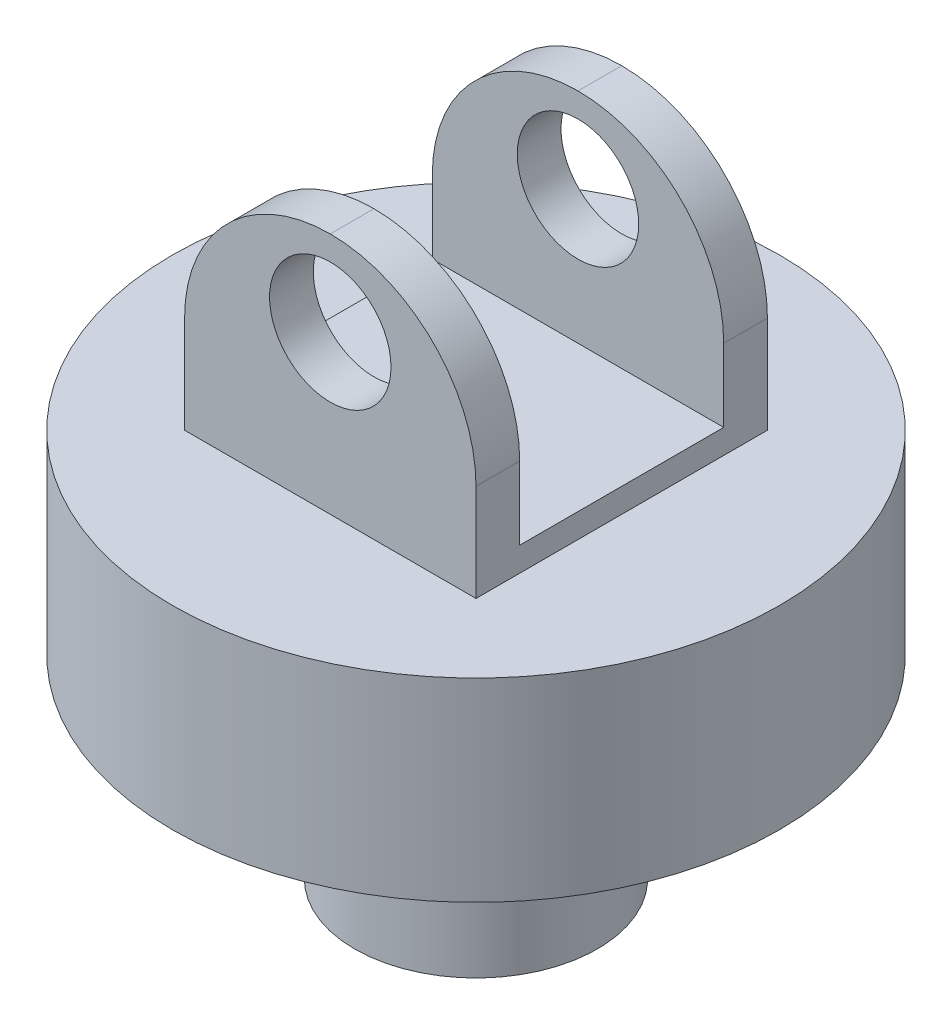
ISO-10303-21;
HEADER;
FILE_DESCRIPTION(('STEP AP214'),'2;1');
FILE_NAME('part.step','',(''),(''),'','','');
FILE_SCHEMA(('AUTOMOTIVE_DESIGN { 1 0 10303 214 1 1 1 1 }'));
ENDSEC;
DATA;
#1=APPLICATION_CONTEXT('core data for automotive mechanical design processes');
#2=APPLICATION_PROTOCOL_DEFINITION('international standard','automotive_design',2000,#1);
#3=PRODUCT_CONTEXT('',#1,'mechanical');
#4=PRODUCT('Part','Part','',(#3));
#5=PRODUCT_RELATED_PRODUCT_CATEGORY('part','',(#4));
#6=PRODUCT_DEFINITION_FORMATION('','',#4);
#7=PRODUCT_DEFINITION_CONTEXT('part definition',#1,'design');
#8=PRODUCT_DEFINITION('design','',#6,#7);
#9=PRODUCT_DEFINITION_SHAPE('','',#8);
#10=(LENGTH_UNIT() NAMED_UNIT(*) SI_UNIT(.MILLI.,.METRE.));
#11=(NAMED_UNIT(*) PLANE_ANGLE_UNIT() SI_UNIT($,.RADIAN.));
#12=(NAMED_UNIT(*) SI_UNIT($,.STERADIAN.) SOLID_ANGLE_UNIT());
#13=UNCERTAINTY_MEASURE_WITH_UNIT(LENGTH_MEASURE(1.E-05),#10,'distance_accuracy_value','');
#14=(GEOMETRIC_REPRESENTATION_CONTEXT(3) GLOBAL_UNCERTAINTY_ASSIGNED_CONTEXT((#13)) GLOBAL_UNIT_ASSIGNED_CONTEXT((#10,
#11,#12)) REPRESENTATION_CONTEXT('',''));
#15=CARTESIAN_POINT('',(0.,0.,0.));
#16=DIRECTION('',(0.,0.,1.));
#17=DIRECTION('',(1.,0.,0.));
#18=AXIS2_PLACEMENT_3D('',#15,#16,#17);
#19=CARTESIAN_POINT('',(0.,80.,0.));
#20=DIRECTION('',(0.,-1.,0.));
#21=DIRECTION('',(0.,0.,-1.));
#22=AXIS2_PLACEMENT_3D('',#19,#20,#21);
#23=CYLINDRICAL_SURFACE('',#22,125.);
#24=CARTESIAN_POINT('',(0.,80.,0.));
#25=DIRECTION('',(0.,1.,0.));
#26=DIRECTION('',(0.,0.,1.));
#27=AXIS2_PLACEMENT_3D('',#24,#25,#26);
#28=CIRCLE('',#27,125.);
#29=CARTESIAN_POINT('',(0.,80.,125.));
#30=VERTEX_POINT('',#29);
#31=EDGE_CURVE('E163',#30,#30,#28,.T.);
#32=ORIENTED_EDGE('',*,*,#31,.F.);
#33=EDGE_LOOP('',(#32));
#34=FACE_BOUND('',#33,.T.);
#35=CARTESIAN_POINT('',(0.,0.,0.));
#36=DIRECTION('',(0.,1.,0.));
#37=DIRECTION('',(0.,0.,1.));
#38=AXIS2_PLACEMENT_3D('',#35,#36,#37);
#39=CIRCLE('',#38,125.);
#40=CARTESIAN_POINT('',(0.,0.,125.));
#41=VERTEX_POINT('',#40);
#42=EDGE_CURVE('E167',#41,#41,#39,.T.);
#43=ORIENTED_EDGE('',*,*,#42,.T.);
#44=EDGE_LOOP('',(#43));
#45=FACE_BOUND('',#44,.T.);
#46=ADVANCED_FACE('F32',(#34,#45),#23,.T.);
#47=CARTESIAN_POINT('',(0.,80.,0.));
#48=DIRECTION('',(0.,1.,0.));
#49=DIRECTION('',(0.,0.,1.));
#50=AXIS2_PLACEMENT_3D('',#47,#48,#49);
#51=PLANE('',#50);
#52=DIRECTION('',(0.,0.,1.));
#53=VECTOR('',#52,1.);
#54=CARTESIAN_POINT('',(-60.,80.,60.));
#55=LINE('',#54,#53);
#56=CARTESIAN_POINT('',(-60.,80.,-60.));
#57=VERTEX_POINT('',#56);
#58=CARTESIAN_POINT('',(-60.,80.,60.));
#59=VERTEX_POINT('',#58);
#60=EDGE_CURVE('E138',#57,#59,#55,.T.);
#61=ORIENTED_EDGE('',*,*,#60,.F.);
#62=DIRECTION('',(-1.,0.,0.));
#63=VECTOR('',#62,1.);
#64=CARTESIAN_POINT('',(60.,80.,-60.));
#65=LINE('',#64,#63);
#66=CARTESIAN_POINT('',(60.,80.,-60.));
#67=VERTEX_POINT('',#66);
#68=EDGE_CURVE('E148',#67,#57,#65,.T.);
#69=ORIENTED_EDGE('',*,*,#68,.F.);
#70=DIRECTION('',(0.,0.,-1.));
#71=VECTOR('',#70,1.);
#72=CARTESIAN_POINT('',(60.,80.,60.));
#73=LINE('',#72,#71);
#74=CARTESIAN_POINT('',(60.,80.,60.));
#75=VERTEX_POINT('',#74);
#76=EDGE_CURVE('E145',#75,#67,#73,.T.);
#77=ORIENTED_EDGE('',*,*,#76,.F.);
#78=DIRECTION('',(1.,0.,0.));
#79=VECTOR('',#78,1.);
#80=CARTESIAN_POINT('',(60.,80.,60.));
#81=LINE('',#80,#79);
#82=EDGE_CURVE('E141',#59,#75,#81,.T.);
#83=ORIENTED_EDGE('',*,*,#82,.F.);
#84=EDGE_LOOP('',(#61,#69,#77,#83));
#85=FACE_BOUND('',#84,.T.);
#86=ORIENTED_EDGE('',*,*,#31,.T.);
#87=EDGE_LOOP('',(#86));
#88=FACE_BOUND('',#87,.T.);
#89=ADVANCED_FACE('F233',(#85,#88),#51,.T.);
#90=CARTESIAN_POINT('',(0.,0.,0.));
#91=DIRECTION('',(0.,1.,0.));
#92=DIRECTION('',(0.,0.,1.));
#93=AXIS2_PLACEMENT_3D('',#90,#91,#92);
#94=PLANE('',#93);
#95=CARTESIAN_POINT('',(0.,0.,0.));
#96=DIRECTION('',(0.,1.,0.));
#97=DIRECTION('',(0.,0.,1.));
#98=AXIS2_PLACEMENT_3D('',#95,#96,#97);
#99=CIRCLE('',#98,50.);
#100=CARTESIAN_POINT('',(0.,0.,50.));
#101=VERTEX_POINT('',#100);
#102=EDGE_CURVE('E162',#101,#101,#99,.T.);
#103=ORIENTED_EDGE('',*,*,#102,.T.);
#104=EDGE_LOOP('',(#103));
#105=FACE_BOUND('',#104,.T.);
#106=ORIENTED_EDGE('',*,*,#42,.F.);
#107=EDGE_LOOP('',(#106));
#108=FACE_BOUND('',#107,.T.);
#109=ADVANCED_FACE('F256',(#105,#108),#94,.F.);
#110=CARTESIAN_POINT('',(0.,-80.,0.));
#111=DIRECTION('',(0.,1.,0.));
#112=DIRECTION('',(0.,0.,1.));
#113=AXIS2_PLACEMENT_3D('',#110,#111,#112);
#114=CYLINDRICAL_SURFACE('',#113,50.);
#115=CARTESIAN_POINT('',(0.,-80.,0.));
#116=DIRECTION('',(0.,1.,0.));
#117=DIRECTION('',(0.,0.,1.));
#118=AXIS2_PLACEMENT_3D('',#115,#116,#117);
#119=CIRCLE('',#118,50.);
#120=CARTESIAN_POINT('',(0.,-80.,50.));
#121=VERTEX_POINT('',#120);
#122=EDGE_CURVE('E159',#121,#121,#119,.T.);
#123=ORIENTED_EDGE('',*,*,#122,.T.);
#124=EDGE_LOOP('',(#123));
#125=FACE_BOUND('',#124,.T.);
#126=ORIENTED_EDGE('',*,*,#102,.F.);
#127=EDGE_LOOP('',(#126));
#128=FACE_BOUND('',#127,.T.);
#129=ADVANCED_FACE('F289',(#125,#128),#114,.T.);
#130=CARTESIAN_POINT('',(0.,-80.,0.));
#131=DIRECTION('',(0.,1.,0.));
#132=DIRECTION('',(0.,0.,1.));
#133=AXIS2_PLACEMENT_3D('',#130,#131,#132);
#134=PLANE('',#133);
#135=ORIENTED_EDGE('',*,*,#122,.F.);
#136=EDGE_LOOP('',(#135));
#137=FACE_BOUND('',#136,.T.);
#138=ADVANCED_FACE('F286',(#137),#134,.F.);
#139=CARTESIAN_POINT('',(-60.,180.,60.));
#140=DIRECTION('',(1.,0.,0.));
#141=DIRECTION('',(0.,0.,-1.));
#142=AXIS2_PLACEMENT_3D('',#139,#140,#141);
#143=PLANE('',#142);
#144=DIRECTION('',(0.,-1.,0.));
#145=VECTOR('',#144,1.);
#146=CARTESIAN_POINT('',(-60.,180.,60.));
#147=LINE('',#146,#145);
#148=CARTESIAN_POINT('',(-60.,120.,60.));
#149=VERTEX_POINT('',#148);
#150=EDGE_CURVE('E157',#149,#59,#147,.T.);
#151=ORIENTED_EDGE('',*,*,#150,.F.);
#152=DIRECTION('',(0.,0.,1.));
#153=VECTOR('',#152,1.);
#154=CARTESIAN_POINT('',(-60.,120.,42.));
#155=LINE('',#154,#153);
#156=CARTESIAN_POINT('',(-60.,120.,42.));
#157=VERTEX_POINT('',#156);
#158=EDGE_CURVE('E178',#149,#157,#155,.F.);
#159=ORIENTED_EDGE('',*,*,#158,.T.);
#160=DIRECTION('',(0.,1.,0.));
#161=VECTOR('',#160,1.);
#162=CARTESIAN_POINT('',(-60.,90.,42.));
#163=LINE('',#162,#161);
#164=CARTESIAN_POINT('',(-60.,90.,42.));
#165=VERTEX_POINT('',#164);
#166=EDGE_CURVE('E133',#165,#157,#163,.T.);
#167=ORIENTED_EDGE('',*,*,#166,.F.);
#168=DIRECTION('',(0.,0.,1.));
#169=VECTOR('',#168,1.);
#170=CARTESIAN_POINT('',(-60.,90.,42.));
#171=LINE('',#170,#169);
#172=CARTESIAN_POINT('',(-60.,90.,-42.));
#173=VERTEX_POINT('',#172);
#174=EDGE_CURVE('E118',#173,#165,#171,.T.);
#175=ORIENTED_EDGE('',*,*,#174,.F.);
#176=DIRECTION('',(0.,1.,0.));
#177=VECTOR('',#176,1.);
#178=CARTESIAN_POINT('',(-60.,90.,-42.));
#179=LINE('',#178,#177);
#180=CARTESIAN_POINT('',(-60.,120.,-42.));
#181=VERTEX_POINT('',#180);
#182=EDGE_CURVE('E115',#173,#181,#179,.T.);
#183=ORIENTED_EDGE('',*,*,#182,.T.);
#184=DIRECTION('',(0.,0.,1.));
#185=VECTOR('',#184,1.);
#186=CARTESIAN_POINT('',(-60.,120.,-60.));
#187=LINE('',#186,#185);
#188=CARTESIAN_POINT('',(-60.,120.,-60.));
#189=VERTEX_POINT('',#188);
#190=EDGE_CURVE('E175',#181,#189,#187,.F.);
#191=ORIENTED_EDGE('',*,*,#190,.T.);
#192=DIRECTION('',(0.,-1.,0.));
#193=VECTOR('',#192,1.);
#194=CARTESIAN_POINT('',(-60.,180.,-60.));
#195=LINE('',#194,#193);
#196=EDGE_CURVE('E151',#189,#57,#195,.T.);
#197=ORIENTED_EDGE('',*,*,#196,.T.);
#198=ORIENTED_EDGE('',*,*,#60,.T.);
#199=EDGE_LOOP('',(#151,#159,#167,#175,#183,#191,#197,#198));
#200=FACE_BOUND('',#199,.T.);
#201=ADVANCED_FACE('F216',(#200),#143,.F.);
#202=CARTESIAN_POINT('',(60.,180.,60.));
#203=DIRECTION('',(0.,0.,-1.));
#204=DIRECTION('',(-1.,0.,0.));
#205=AXIS2_PLACEMENT_3D('',#202,#203,#204);
#206=PLANE('',#205);
#207=CARTESIAN_POINT('',(0.,145.,60.));
#208=DIRECTION('',(0.,0.,1.));
#209=DIRECTION('',(1.,0.,0.));
#210=AXIS2_PLACEMENT_3D('',#207,#208,#209);
#211=CIRCLE('',#210,25.);
#212=CARTESIAN_POINT('',(25.,145.,60.));
#213=VERTEX_POINT('',#212);
#214=EDGE_CURVE('E393',#213,#213,#211,.T.);
#215=ORIENTED_EDGE('',*,*,#214,.F.);
#216=EDGE_LOOP('',(#215));
#217=FACE_BOUND('',#216,.T.);
#218=CARTESIAN_POINT('',(0.,120.,60.));
#219=DIRECTION('',(0.,0.,-1.));
#220=DIRECTION('',(-1.,0.,0.));
#221=AXIS2_PLACEMENT_3D('',#218,#219,#220);
#222=CIRCLE('',#221,60.);
#223=CARTESIAN_POINT('',(60.,120.,60.));
#224=VERTEX_POINT('',#223);
#225=CARTESIAN_POINT('',(0.,180.,60.));
#226=VERTEX_POINT('',#225);
#227=EDGE_CURVE('E166',#224,#226,#222,.F.);
#228=ORIENTED_EDGE('',*,*,#227,.T.);
#229=CARTESIAN_POINT('',(0.,120.,60.));
#230=DIRECTION('',(0.,0.,-1.));
#231=DIRECTION('',(-1.,0.,0.));
#232=AXIS2_PLACEMENT_3D('',#229,#230,#231);
#233=CIRCLE('',#232,60.);
#234=EDGE_CURVE('E173',#226,#149,#233,.F.);
#235=ORIENTED_EDGE('',*,*,#234,.T.);
#236=ORIENTED_EDGE('',*,*,#150,.T.);
#237=ORIENTED_EDGE('',*,*,#82,.T.);
#238=DIRECTION('',(0.,-1.,0.));
#239=VECTOR('',#238,1.);
#240=CARTESIAN_POINT('',(60.,180.,60.));
#241=LINE('',#240,#239);
#242=EDGE_CURVE('E155',#224,#75,#241,.T.);
#243=ORIENTED_EDGE('',*,*,#242,.F.);
#244=EDGE_LOOP('',(#228,#235,#236,#237,#243));
#245=FACE_BOUND('',#244,.T.);
#246=ADVANCED_FACE('F229',(#217,#245),#206,.F.);
#247=CARTESIAN_POINT('',(60.,180.,60.));
#248=DIRECTION('',(-1.,0.,0.));
#249=DIRECTION('',(0.,0.,1.));
#250=AXIS2_PLACEMENT_3D('',#247,#248,#249);
#251=PLANE('',#250);
#252=DIRECTION('',(0.,-1.,0.));
#253=VECTOR('',#252,1.);
#254=CARTESIAN_POINT('',(60.,180.,-60.));
#255=LINE('',#254,#253);
#256=CARTESIAN_POINT('',(60.,120.,-60.));
#257=VERTEX_POINT('',#256);
#258=EDGE_CURVE('E153',#257,#67,#255,.T.);
#259=ORIENTED_EDGE('',*,*,#258,.F.);
#260=DIRECTION('',(0.,0.,-1.));
#261=VECTOR('',#260,1.);
#262=CARTESIAN_POINT('',(60.,120.,-42.));
#263=LINE('',#262,#261);
#264=CARTESIAN_POINT('',(60.,120.,-42.));
#265=VERTEX_POINT('',#264);
#266=EDGE_CURVE('E11',#257,#265,#263,.F.);
#267=ORIENTED_EDGE('',*,*,#266,.T.);
#268=DIRECTION('',(0.,1.,0.));
#269=VECTOR('',#268,1.);
#270=CARTESIAN_POINT('',(60.,90.,-42.));
#271=LINE('',#270,#269);
#272=CARTESIAN_POINT('',(60.,90.,-42.));
#273=VERTEX_POINT('',#272);
#274=EDGE_CURVE('E112',#273,#265,#271,.T.);
#275=ORIENTED_EDGE('',*,*,#274,.F.);
#276=DIRECTION('',(0.,0.,-1.));
#277=VECTOR('',#276,1.);
#278=CARTESIAN_POINT('',(60.,90.,42.));
#279=LINE('',#278,#277);
#280=CARTESIAN_POINT('',(60.,90.,42.));
#281=VERTEX_POINT('',#280);
#282=EDGE_CURVE('E119',#281,#273,#279,.T.);
#283=ORIENTED_EDGE('',*,*,#282,.F.);
#284=DIRECTION('',(0.,1.,0.));
#285=VECTOR('',#284,1.);
#286=CARTESIAN_POINT('',(60.,90.,42.));
#287=LINE('',#286,#285);
#288=CARTESIAN_POINT('',(60.,120.,42.));
#289=VERTEX_POINT('',#288);
#290=EDGE_CURVE('E142',#281,#289,#287,.T.);
#291=ORIENTED_EDGE('',*,*,#290,.T.);
#292=DIRECTION('',(0.,0.,-1.));
#293=VECTOR('',#292,1.);
#294=CARTESIAN_POINT('',(60.,120.,60.));
#295=LINE('',#294,#293);
#296=EDGE_CURVE('E41',#289,#224,#295,.F.);
#297=ORIENTED_EDGE('',*,*,#296,.T.);
#298=ORIENTED_EDGE('',*,*,#242,.T.);
#299=ORIENTED_EDGE('',*,*,#76,.T.);
#300=EDGE_LOOP('',(#259,#267,#275,#283,#291,#297,#298,#299));
#301=FACE_BOUND('',#300,.T.);
#302=ADVANCED_FACE('F130',(#301),#251,.F.);
#303=CARTESIAN_POINT('',(60.,180.,-60.));
#304=DIRECTION('',(0.,0.,1.));
#305=DIRECTION('',(1.,0.,0.));
#306=AXIS2_PLACEMENT_3D('',#303,#304,#305);
#307=PLANE('',#306);
#308=CARTESIAN_POINT('',(0.,145.,-60.));
#309=DIRECTION('',(0.,0.,1.));
#310=DIRECTION('',(1.,0.,0.));
#311=AXIS2_PLACEMENT_3D('',#308,#309,#310);
#312=CIRCLE('',#311,25.);
#313=CARTESIAN_POINT('',(25.,145.,-60.));
#314=VERTEX_POINT('',#313);
#315=EDGE_CURVE('E195',#314,#314,#312,.T.);
#316=ORIENTED_EDGE('',*,*,#315,.T.);
#317=EDGE_LOOP('',(#316));
#318=FACE_BOUND('',#317,.T.);
#319=ORIENTED_EDGE('',*,*,#196,.F.);
#320=CARTESIAN_POINT('',(0.,120.,-60.));
#321=DIRECTION('',(0.,0.,1.));
#322=DIRECTION('',(1.,0.,0.));
#323=AXIS2_PLACEMENT_3D('',#320,#321,#322);
#324=CIRCLE('',#323,60.);
#325=CARTESIAN_POINT('',(0.,180.,-60.));
#326=VERTEX_POINT('',#325);
#327=EDGE_CURVE('E54',#189,#326,#324,.F.);
#328=ORIENTED_EDGE('',*,*,#327,.T.);
#329=CARTESIAN_POINT('',(0.,120.,-60.));
#330=DIRECTION('',(0.,0.,1.));
#331=DIRECTION('',(1.,0.,0.));
#332=AXIS2_PLACEMENT_3D('',#329,#330,#331);
#333=CIRCLE('',#332,60.);
#334=EDGE_CURVE('E49',#326,#257,#333,.F.);
#335=ORIENTED_EDGE('',*,*,#334,.T.);
#336=ORIENTED_EDGE('',*,*,#258,.T.);
#337=ORIENTED_EDGE('',*,*,#68,.T.);
#338=EDGE_LOOP('',(#319,#328,#335,#336,#337));
#339=FACE_BOUND('',#338,.T.);
#340=ADVANCED_FACE('F237',(#318,#339),#307,.F.);
#341=CARTESIAN_POINT('',(-60.,90.,42.));
#342=DIRECTION('',(0.,0.,1.));
#343=DIRECTION('',(1.,0.,0.));
#344=AXIS2_PLACEMENT_3D('',#341,#342,#343);
#345=PLANE('',#344);
#346=CARTESIAN_POINT('',(0.,145.,42.));
#347=DIRECTION('',(0.,0.,1.));
#348=DIRECTION('',(1.,0.,0.));
#349=AXIS2_PLACEMENT_3D('',#346,#347,#348);
#350=CIRCLE('',#349,25.);
#351=CARTESIAN_POINT('',(25.,145.,42.));
#352=VERTEX_POINT('',#351);
#353=EDGE_CURVE('E200',#352,#352,#350,.T.);
#354=ORIENTED_EDGE('',*,*,#353,.T.);
#355=EDGE_LOOP('',(#354));
#356=FACE_BOUND('',#355,.T.);
#357=ORIENTED_EDGE('',*,*,#166,.T.);
#358=CARTESIAN_POINT('',(0.,120.,42.));
#359=DIRECTION('',(0.,0.,1.));
#360=DIRECTION('',(1.,0.,0.));
#361=AXIS2_PLACEMENT_3D('',#358,#359,#360);
#362=CIRCLE('',#361,60.);
#363=CARTESIAN_POINT('',(0.,180.,42.));
#364=VERTEX_POINT('',#363);
#365=EDGE_CURVE('E183',#157,#364,#362,.F.);
#366=ORIENTED_EDGE('',*,*,#365,.T.);
#367=CARTESIAN_POINT('',(0.,120.,42.));
#368=DIRECTION('',(0.,0.,1.));
#369=DIRECTION('',(1.,0.,0.));
#370=AXIS2_PLACEMENT_3D('',#367,#368,#369);
#371=CIRCLE('',#370,60.);
#372=EDGE_CURVE('E181',#364,#289,#371,.F.);
#373=ORIENTED_EDGE('',*,*,#372,.T.);
#374=ORIENTED_EDGE('',*,*,#290,.F.);
#375=DIRECTION('',(1.,0.,0.));
#376=VECTOR('',#375,1.);
#377=CARTESIAN_POINT('',(-60.,90.,42.));
#378=LINE('',#377,#376);
#379=EDGE_CURVE('E125',#165,#281,#378,.T.);
#380=ORIENTED_EDGE('',*,*,#379,.F.);
#381=EDGE_LOOP('',(#357,#366,#373,#374,#380));
#382=FACE_BOUND('',#381,.T.);
#383=ADVANCED_FACE('F212',(#356,#382),#345,.F.);
#384=CARTESIAN_POINT('',(-60.,90.,-42.));
#385=DIRECTION('',(0.,0.,-1.));
#386=DIRECTION('',(-1.,0.,0.));
#387=AXIS2_PLACEMENT_3D('',#384,#385,#386);
#388=PLANE('',#387);
#389=CARTESIAN_POINT('',(0.,145.,-42.));
#390=DIRECTION('',(0.,0.,-1.));
#391=DIRECTION('',(-1.,0.,0.));
#392=AXIS2_PLACEMENT_3D('',#389,#390,#391);
#393=CIRCLE('',#392,25.);
#394=CARTESIAN_POINT('',(-25.,145.,-42.));
#395=VERTEX_POINT('',#394);
#396=EDGE_CURVE('E36',#395,#395,#393,.T.);
#397=ORIENTED_EDGE('',*,*,#396,.T.);
#398=EDGE_LOOP('',(#397));
#399=FACE_BOUND('',#398,.T.);
#400=CARTESIAN_POINT('',(0.,120.,-42.));
#401=DIRECTION('',(0.,0.,-1.));
#402=DIRECTION('',(-1.,0.,0.));
#403=AXIS2_PLACEMENT_3D('',#400,#401,#402);
#404=CIRCLE('',#403,60.);
#405=CARTESIAN_POINT('',(0.,180.,-42.));
#406=VERTEX_POINT('',#405);
#407=EDGE_CURVE('E185',#265,#406,#404,.F.);
#408=ORIENTED_EDGE('',*,*,#407,.T.);
#409=CARTESIAN_POINT('',(0.,120.,-42.));
#410=DIRECTION('',(0.,0.,-1.));
#411=DIRECTION('',(-1.,0.,0.));
#412=AXIS2_PLACEMENT_3D('',#409,#410,#411);
#413=CIRCLE('',#412,60.);
#414=EDGE_CURVE('E187',#406,#181,#413,.F.);
#415=ORIENTED_EDGE('',*,*,#414,.T.);
#416=ORIENTED_EDGE('',*,*,#182,.F.);
#417=DIRECTION('',(-1.,0.,0.));
#418=VECTOR('',#417,1.);
#419=CARTESIAN_POINT('',(-60.,90.,-42.));
#420=LINE('',#419,#418);
#421=EDGE_CURVE('E108',#273,#173,#420,.T.);
#422=ORIENTED_EDGE('',*,*,#421,.F.);
#423=ORIENTED_EDGE('',*,*,#274,.T.);
#424=EDGE_LOOP('',(#408,#415,#416,#422,#423));
#425=FACE_BOUND('',#424,.T.);
#426=ADVANCED_FACE('F110',(#399,#425),#388,.F.);
#427=CARTESIAN_POINT('',(0.,90.,0.));
#428=DIRECTION('',(0.,-1.,0.));
#429=DIRECTION('',(0.,0.,-1.));
#430=AXIS2_PLACEMENT_3D('',#427,#428,#429);
#431=PLANE('',#430);
#432=ORIENTED_EDGE('',*,*,#282,.T.);
#433=ORIENTED_EDGE('',*,*,#421,.T.);
#434=ORIENTED_EDGE('',*,*,#174,.T.);
#435=ORIENTED_EDGE('',*,*,#379,.T.);
#436=EDGE_LOOP('',(#432,#433,#434,#435));
#437=FACE_BOUND('',#436,.T.);
#438=ADVANCED_FACE('F123',(#437),#431,.F.);
#439=CARTESIAN_POINT('',(0.,120.,0.));
#440=DIRECTION('',(0.,0.,1.));
#441=DIRECTION('',(1.,0.,0.));
#442=AXIS2_PLACEMENT_3D('',#439,#440,#441);
#443=CYLINDRICAL_SURFACE('',#442,60.);
#444=ORIENTED_EDGE('',*,*,#296,.F.);
#445=ORIENTED_EDGE('',*,*,#372,.F.);
#446=DIRECTION('',(0.,0.,-1.));
#447=VECTOR('',#446,1.);
#448=CARTESIAN_POINT('',(0.,180.,42.));
#449=LINE('',#448,#447);
#450=EDGE_CURVE('E128',#226,#364,#449,.T.);
#451=ORIENTED_EDGE('',*,*,#450,.F.);
#452=ORIENTED_EDGE('',*,*,#227,.F.);
#453=EDGE_LOOP('',(#444,#445,#451,#452));
#454=FACE_BOUND('',#453,.T.);
#455=ADVANCED_FACE('F225',(#454),#443,.T.);
#456=CARTESIAN_POINT('',(0.,120.,0.));
#457=DIRECTION('',(0.,0.,-1.));
#458=DIRECTION('',(-1.,0.,0.));
#459=AXIS2_PLACEMENT_3D('',#456,#457,#458);
#460=CYLINDRICAL_SURFACE('',#459,60.);
#461=ORIENTED_EDGE('',*,*,#365,.F.);
#462=ORIENTED_EDGE('',*,*,#158,.F.);
#463=ORIENTED_EDGE('',*,*,#234,.F.);
#464=ORIENTED_EDGE('',*,*,#450,.T.);
#465=EDGE_LOOP('',(#461,#462,#463,#464));
#466=FACE_BOUND('',#465,.T.);
#467=ADVANCED_FACE('F220',(#466),#460,.T.);
#468=CARTESIAN_POINT('',(0.,120.,0.));
#469=DIRECTION('',(0.,0.,1.));
#470=DIRECTION('',(1.,0.,0.));
#471=AXIS2_PLACEMENT_3D('',#468,#469,#470);
#472=CYLINDRICAL_SURFACE('',#471,60.);
#473=ORIENTED_EDGE('',*,*,#266,.F.);
#474=ORIENTED_EDGE('',*,*,#334,.F.);
#475=DIRECTION('',(0.,0.,-1.));
#476=VECTOR('',#475,1.);
#477=CARTESIAN_POINT('',(0.,180.,-60.));
#478=LINE('',#477,#476);
#479=EDGE_CURVE('E193',#406,#326,#478,.T.);
#480=ORIENTED_EDGE('',*,*,#479,.F.);
#481=ORIENTED_EDGE('',*,*,#407,.F.);
#482=EDGE_LOOP('',(#473,#474,#480,#481));
#483=FACE_BOUND('',#482,.T.);
#484=ADVANCED_FACE('F34',(#483),#472,.T.);
#485=CARTESIAN_POINT('',(0.,120.,0.));
#486=DIRECTION('',(0.,0.,-1.));
#487=DIRECTION('',(-1.,0.,0.));
#488=AXIS2_PLACEMENT_3D('',#485,#486,#487);
#489=CYLINDRICAL_SURFACE('',#488,60.);
#490=ORIENTED_EDGE('',*,*,#327,.F.);
#491=ORIENTED_EDGE('',*,*,#190,.F.);
#492=ORIENTED_EDGE('',*,*,#414,.F.);
#493=ORIENTED_EDGE('',*,*,#479,.T.);
#494=EDGE_LOOP('',(#490,#491,#492,#493));
#495=FACE_BOUND('',#494,.T.);
#496=ADVANCED_FACE('F239',(#495),#489,.T.);
#497=CARTESIAN_POINT('',(0.,145.,-70.));
#498=DIRECTION('',(0.,0.,1.));
#499=DIRECTION('',(1.,0.,0.));
#500=AXIS2_PLACEMENT_3D('',#497,#498,#499);
#501=CYLINDRICAL_SURFACE('',#500,25.);
#502=ORIENTED_EDGE('',*,*,#396,.F.);
#503=EDGE_LOOP('',(#502));
#504=FACE_BOUND('',#503,.T.);
#505=ORIENTED_EDGE('',*,*,#315,.F.);
#506=EDGE_LOOP('',(#505));
#507=FACE_BOUND('',#506,.T.);
#508=ADVANCED_FACE('F241',(#504,#507),#501,.F.);
#509=ORIENTED_EDGE('',*,*,#214,.T.);
#510=EDGE_LOOP('',(#509));
#511=FACE_BOUND('',#510,.T.);
#512=ORIENTED_EDGE('',*,*,#353,.F.);
#513=EDGE_LOOP('',(#512));
#514=FACE_BOUND('',#513,.T.);
#515=ADVANCED_FACE('F246',(#511,#514),#501,.F.);
#516=CLOSED_SHELL('',(#46,#89,#109,#129,#138,#201,#246,#302,#340,#383,#426,#438,#455,#467,#484,
#496,#508,#515));
#517=MANIFOLD_SOLID_BREP('B2',#516);
#518=ADVANCED_BREP_SHAPE_REPRESENTATION('',(#18,#517),#14);
#519=SHAPE_DEFINITION_REPRESENTATION(#9,#518);
ENDSEC;
END-ISO-10303-21;
